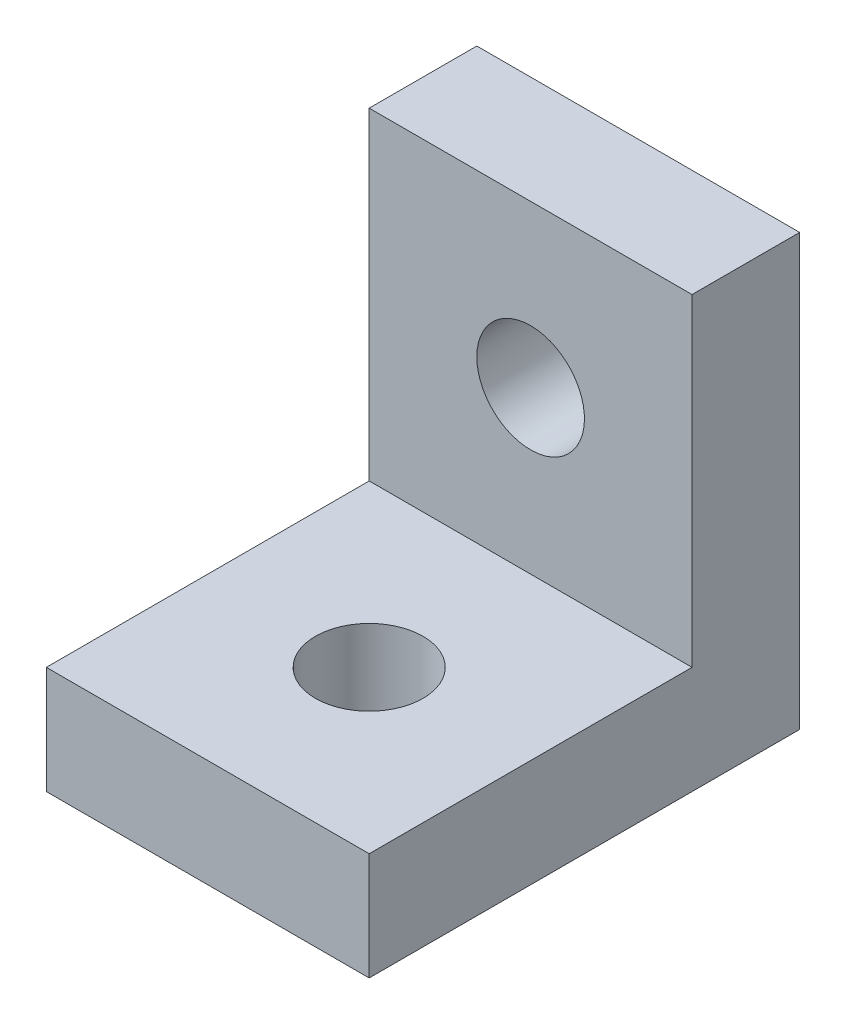
ISO-10303-21;
HEADER;
FILE_DESCRIPTION(('STEP AP214'),'2;1');
FILE_NAME('part.step','',(''),(''),'','','');
FILE_SCHEMA(('AUTOMOTIVE_DESIGN { 1 0 10303 214 1 1 1 1 }'));
ENDSEC;
DATA;
#1=APPLICATION_CONTEXT('core data for automotive mechanical design processes');
#2=APPLICATION_PROTOCOL_DEFINITION('international standard','automotive_design',2000,#1);
#3=PRODUCT_CONTEXT('',#1,'mechanical');
#4=PRODUCT('Part','Part','',(#3));
#5=PRODUCT_RELATED_PRODUCT_CATEGORY('part','',(#4));
#6=PRODUCT_DEFINITION_FORMATION('','',#4);
#7=PRODUCT_DEFINITION_CONTEXT('part definition',#1,'design');
#8=PRODUCT_DEFINITION('design','',#6,#7);
#9=PRODUCT_DEFINITION_SHAPE('','',#8);
#10=(LENGTH_UNIT() NAMED_UNIT(*) SI_UNIT(.MILLI.,.METRE.));
#11=(NAMED_UNIT(*) PLANE_ANGLE_UNIT() SI_UNIT($,.RADIAN.));
#12=(NAMED_UNIT(*) SI_UNIT($,.STERADIAN.) SOLID_ANGLE_UNIT());
#13=UNCERTAINTY_MEASURE_WITH_UNIT(LENGTH_MEASURE(1.E-05),#10,'distance_accuracy_value','');
#14=(GEOMETRIC_REPRESENTATION_CONTEXT(3) GLOBAL_UNCERTAINTY_ASSIGNED_CONTEXT((#13)) GLOBAL_UNIT_ASSIGNED_CONTEXT((#10,
#11,#12)) REPRESENTATION_CONTEXT('',''));
#15=CARTESIAN_POINT('',(0.,0.,0.));
#16=DIRECTION('',(0.,0.,1.));
#17=DIRECTION('',(1.,0.,0.));
#18=AXIS2_PLACEMENT_3D('',#15,#16,#17);
#19=CARTESIAN_POINT('',(15.,40.,0.));
#20=DIRECTION('',(0.,-1.,0.));
#21=DIRECTION('',(0.,0.,-1.));
#22=AXIS2_PLACEMENT_3D('',#19,#20,#21);
#23=PLANE('',#22);
#24=DIRECTION('',(0.,0.,1.));
#25=VECTOR('',#24,1.);
#26=CARTESIAN_POINT('',(-15.,40.,0.));
#27=LINE('',#26,#25);
#28=CARTESIAN_POINT('',(-15.,40.,0.));
#29=VERTEX_POINT('',#28);
#30=CARTESIAN_POINT('',(-15.,40.,10.));
#31=VERTEX_POINT('',#30);
#32=EDGE_CURVE('E123',#29,#31,#27,.T.);
#33=ORIENTED_EDGE('',*,*,#32,.T.);
#34=DIRECTION('',(-1.,0.,0.));
#35=VECTOR('',#34,1.);
#36=CARTESIAN_POINT('',(15.,40.,10.));
#37=LINE('',#36,#35);
#38=CARTESIAN_POINT('',(15.,40.,10.));
#39=VERTEX_POINT('',#38);
#40=EDGE_CURVE('E11',#39,#31,#37,.T.);
#41=ORIENTED_EDGE('',*,*,#40,.F.);
#42=DIRECTION('',(0.,0.,1.));
#43=VECTOR('',#42,1.);
#44=CARTESIAN_POINT('',(15.,40.,0.));
#45=LINE('',#44,#43);
#46=CARTESIAN_POINT('',(15.,40.,0.));
#47=VERTEX_POINT('',#46);
#48=EDGE_CURVE('E134',#47,#39,#45,.T.);
#49=ORIENTED_EDGE('',*,*,#48,.F.);
#50=DIRECTION('',(-1.,0.,0.));
#51=VECTOR('',#50,1.);
#52=CARTESIAN_POINT('',(15.,40.,0.));
#53=LINE('',#52,#51);
#54=EDGE_CURVE('E119',#47,#29,#53,.T.);
#55=ORIENTED_EDGE('',*,*,#54,.T.);
#56=EDGE_LOOP('',(#33,#41,#49,#55));
#57=FACE_BOUND('',#56,.T.);
#58=ADVANCED_FACE('F39',(#57),#23,.F.);
#59=CARTESIAN_POINT('',(15.,40.,10.));
#60=DIRECTION('',(0.,0.,-1.));
#61=DIRECTION('',(-1.,0.,0.));
#62=AXIS2_PLACEMENT_3D('',#59,#60,#61);
#63=PLANE('',#62);
#64=CARTESIAN_POINT('',(0.,25.,10.));
#65=DIRECTION('',(0.,0.,-1.));
#66=DIRECTION('',(-1.,0.,0.));
#67=AXIS2_PLACEMENT_3D('',#64,#65,#66);
#68=CIRCLE('',#67,5.);
#69=CARTESIAN_POINT('',(-5.,25.,10.));
#70=VERTEX_POINT('',#69);
#71=EDGE_CURVE('E127',#70,#70,#68,.F.);
#72=ORIENTED_EDGE('',*,*,#71,.F.);
#73=EDGE_LOOP('',(#72));
#74=FACE_BOUND('',#73,.T.);
#75=DIRECTION('',(0.,-1.,0.));
#76=VECTOR('',#75,1.);
#77=CARTESIAN_POINT('',(-15.,40.,10.));
#78=LINE('',#77,#76);
#79=CARTESIAN_POINT('',(-15.,10.,10.));
#80=VERTEX_POINT('',#79);
#81=EDGE_CURVE('E126',#31,#80,#78,.T.);
#82=ORIENTED_EDGE('',*,*,#81,.T.);
#83=DIRECTION('',(-1.,0.,0.));
#84=VECTOR('',#83,1.);
#85=CARTESIAN_POINT('',(15.,10.,10.));
#86=LINE('',#85,#84);
#87=CARTESIAN_POINT('',(15.,10.,10.));
#88=VERTEX_POINT('',#87);
#89=EDGE_CURVE('E47',#88,#80,#86,.T.);
#90=ORIENTED_EDGE('',*,*,#89,.F.);
#91=DIRECTION('',(0.,-1.,0.));
#92=VECTOR('',#91,1.);
#93=CARTESIAN_POINT('',(15.,40.,10.));
#94=LINE('',#93,#92);
#95=EDGE_CURVE('E92',#39,#88,#94,.T.);
#96=ORIENTED_EDGE('',*,*,#95,.F.);
#97=ORIENTED_EDGE('',*,*,#40,.T.);
#98=EDGE_LOOP('',(#82,#90,#96,#97));
#99=FACE_BOUND('',#98,.T.);
#100=ADVANCED_FACE('F161',(#74,#99),#63,.F.);
#101=CARTESIAN_POINT('',(15.,10.,10.));
#102=DIRECTION('',(0.,-1.,0.));
#103=DIRECTION('',(0.,0.,-1.));
#104=AXIS2_PLACEMENT_3D('',#101,#102,#103);
#105=PLANE('',#104);
#106=CARTESIAN_POINT('',(0.,10.,25.));
#107=DIRECTION('',(0.,1.,0.));
#108=DIRECTION('',(0.,0.,1.));
#109=AXIS2_PLACEMENT_3D('',#106,#107,#108);
#110=CIRCLE('',#109,5.);
#111=CARTESIAN_POINT('',(0.,10.,30.));
#112=VERTEX_POINT('',#111);
#113=EDGE_CURVE('E249',#112,#112,#110,.T.);
#114=ORIENTED_EDGE('',*,*,#113,.F.);
#115=EDGE_LOOP('',(#114));
#116=FACE_BOUND('',#115,.T.);
#117=DIRECTION('',(0.,0.,1.));
#118=VECTOR('',#117,1.);
#119=CARTESIAN_POINT('',(-15.,10.,10.));
#120=LINE('',#119,#118);
#121=CARTESIAN_POINT('',(-15.,10.,40.));
#122=VERTEX_POINT('',#121);
#123=EDGE_CURVE('E129',#80,#122,#120,.T.);
#124=ORIENTED_EDGE('',*,*,#123,.T.);
#125=DIRECTION('',(-1.,0.,0.));
#126=VECTOR('',#125,1.);
#127=CARTESIAN_POINT('',(15.,10.,40.));
#128=LINE('',#127,#126);
#129=CARTESIAN_POINT('',(15.,10.,40.));
#130=VERTEX_POINT('',#129);
#131=EDGE_CURVE('E114',#130,#122,#128,.T.);
#132=ORIENTED_EDGE('',*,*,#131,.F.);
#133=DIRECTION('',(0.,0.,1.));
#134=VECTOR('',#133,1.);
#135=CARTESIAN_POINT('',(15.,10.,10.));
#136=LINE('',#135,#134);
#137=EDGE_CURVE('E105',#88,#130,#136,.T.);
#138=ORIENTED_EDGE('',*,*,#137,.F.);
#139=ORIENTED_EDGE('',*,*,#89,.T.);
#140=EDGE_LOOP('',(#124,#132,#138,#139));
#141=FACE_BOUND('',#140,.T.);
#142=ADVANCED_FACE('F140',(#116,#141),#105,.F.);
#143=CARTESIAN_POINT('',(15.,0.,40.));
#144=DIRECTION('',(0.,0.,-1.));
#145=DIRECTION('',(-1.,0.,0.));
#146=AXIS2_PLACEMENT_3D('',#143,#144,#145);
#147=PLANE('',#146);
#148=DIRECTION('',(0.,-1.,0.));
#149=VECTOR('',#148,1.);
#150=CARTESIAN_POINT('',(-15.,0.,40.));
#151=LINE('',#150,#149);
#152=CARTESIAN_POINT('',(-15.,0.,40.));
#153=VERTEX_POINT('',#152);
#154=EDGE_CURVE('E113',#122,#153,#151,.T.);
#155=ORIENTED_EDGE('',*,*,#154,.T.);
#156=DIRECTION('',(-1.,0.,0.));
#157=VECTOR('',#156,1.);
#158=CARTESIAN_POINT('',(15.,0.,40.));
#159=LINE('',#158,#157);
#160=CARTESIAN_POINT('',(15.,0.,40.));
#161=VERTEX_POINT('',#160);
#162=EDGE_CURVE('E110',#161,#153,#159,.T.);
#163=ORIENTED_EDGE('',*,*,#162,.F.);
#164=DIRECTION('',(0.,-1.,0.));
#165=VECTOR('',#164,1.);
#166=CARTESIAN_POINT('',(15.,0.,40.));
#167=LINE('',#166,#165);
#168=EDGE_CURVE('E99',#130,#161,#167,.T.);
#169=ORIENTED_EDGE('',*,*,#168,.F.);
#170=ORIENTED_EDGE('',*,*,#131,.T.);
#171=EDGE_LOOP('',(#155,#163,#169,#170));
#172=FACE_BOUND('',#171,.T.);
#173=ADVANCED_FACE('F111',(#172),#147,.F.);
#174=CARTESIAN_POINT('',(15.,0.,0.));
#175=DIRECTION('',(0.,1.,0.));
#176=DIRECTION('',(0.,0.,1.));
#177=AXIS2_PLACEMENT_3D('',#174,#175,#176);
#178=PLANE('',#177);
#179=CARTESIAN_POINT('',(0.,0.,25.));
#180=DIRECTION('',(0.,1.,0.));
#181=DIRECTION('',(0.,0.,1.));
#182=AXIS2_PLACEMENT_3D('',#179,#180,#181);
#183=CIRCLE('',#182,5.);
#184=CARTESIAN_POINT('',(0.,0.,30.));
#185=VERTEX_POINT('',#184);
#186=EDGE_CURVE('E242',#185,#185,#183,.F.);
#187=ORIENTED_EDGE('',*,*,#186,.F.);
#188=EDGE_LOOP('',(#187));
#189=FACE_BOUND('',#188,.T.);
#190=DIRECTION('',(0.,0.,-1.));
#191=VECTOR('',#190,1.);
#192=CARTESIAN_POINT('',(-15.,0.,0.));
#193=LINE('',#192,#191);
#194=CARTESIAN_POINT('',(-15.,0.,0.));
#195=VERTEX_POINT('',#194);
#196=EDGE_CURVE('E78',#153,#195,#193,.T.);
#197=ORIENTED_EDGE('',*,*,#196,.T.);
#198=DIRECTION('',(-1.,0.,0.));
#199=VECTOR('',#198,1.);
#200=CARTESIAN_POINT('',(15.,0.,0.));
#201=LINE('',#200,#199);
#202=CARTESIAN_POINT('',(15.,0.,0.));
#203=VERTEX_POINT('',#202);
#204=EDGE_CURVE('E115',#203,#195,#201,.T.);
#205=ORIENTED_EDGE('',*,*,#204,.F.);
#206=DIRECTION('',(0.,0.,-1.));
#207=VECTOR('',#206,1.);
#208=CARTESIAN_POINT('',(15.,0.,0.));
#209=LINE('',#208,#207);
#210=EDGE_CURVE('E103',#161,#203,#209,.T.);
#211=ORIENTED_EDGE('',*,*,#210,.F.);
#212=ORIENTED_EDGE('',*,*,#162,.T.);
#213=EDGE_LOOP('',(#197,#205,#211,#212));
#214=FACE_BOUND('',#213,.T.);
#215=ADVANCED_FACE('F117',(#189,#214),#178,.F.);
#216=CARTESIAN_POINT('',(15.,40.,0.));
#217=DIRECTION('',(0.,0.,1.));
#218=DIRECTION('',(0.,-1.,0.));
#219=AXIS2_PLACEMENT_3D('',#216,#217,#218);
#220=PLANE('',#219);
#221=CARTESIAN_POINT('',(0.,25.,0.));
#222=DIRECTION('',(0.,0.,-1.));
#223=DIRECTION('',(0.,1.,0.));
#224=AXIS2_PLACEMENT_3D('',#221,#222,#223);
#225=CIRCLE('',#224,5.);
#226=CARTESIAN_POINT('',(0.,30.,0.));
#227=VERTEX_POINT('',#226);
#228=EDGE_CURVE('E239',#227,#227,#225,.T.);
#229=ORIENTED_EDGE('',*,*,#228,.F.);
#230=EDGE_LOOP('',(#229));
#231=FACE_BOUND('',#230,.T.);
#232=DIRECTION('',(0.,1.,0.));
#233=VECTOR('',#232,1.);
#234=CARTESIAN_POINT('',(-15.,40.,0.));
#235=LINE('',#234,#233);
#236=EDGE_CURVE('E84',#195,#29,#235,.T.);
#237=ORIENTED_EDGE('',*,*,#236,.T.);
#238=ORIENTED_EDGE('',*,*,#54,.F.);
#239=DIRECTION('',(0.,1.,0.));
#240=VECTOR('',#239,1.);
#241=CARTESIAN_POINT('',(15.,40.,0.));
#242=LINE('',#241,#240);
#243=EDGE_CURVE('E55',#203,#47,#242,.T.);
#244=ORIENTED_EDGE('',*,*,#243,.F.);
#245=ORIENTED_EDGE('',*,*,#204,.T.);
#246=EDGE_LOOP('',(#237,#238,#244,#245));
#247=FACE_BOUND('',#246,.T.);
#248=ADVANCED_FACE('F147',(#231,#247),#220,.F.);
#249=CARTESIAN_POINT('',(15.,0.,0.));
#250=DIRECTION('',(1.,0.,0.));
#251=DIRECTION('',(0.,0.,-1.));
#252=AXIS2_PLACEMENT_3D('',#249,#250,#251);
#253=PLANE('',#252);
#254=ORIENTED_EDGE('',*,*,#48,.T.);
#255=ORIENTED_EDGE('',*,*,#95,.T.);
#256=ORIENTED_EDGE('',*,*,#137,.T.);
#257=ORIENTED_EDGE('',*,*,#168,.T.);
#258=ORIENTED_EDGE('',*,*,#210,.T.);
#259=ORIENTED_EDGE('',*,*,#243,.T.);
#260=EDGE_LOOP('',(#254,#255,#256,#257,#258,#259));
#261=FACE_BOUND('',#260,.T.);
#262=ADVANCED_FACE('F101',(#261),#253,.T.);
#263=CARTESIAN_POINT('',(-15.,0.,0.));
#264=DIRECTION('',(1.,0.,0.));
#265=DIRECTION('',(0.,0.,-1.));
#266=AXIS2_PLACEMENT_3D('',#263,#264,#265);
#267=PLANE('',#266);
#268=ORIENTED_EDGE('',*,*,#32,.F.);
#269=ORIENTED_EDGE('',*,*,#236,.F.);
#270=ORIENTED_EDGE('',*,*,#196,.F.);
#271=ORIENTED_EDGE('',*,*,#154,.F.);
#272=ORIENTED_EDGE('',*,*,#123,.F.);
#273=ORIENTED_EDGE('',*,*,#81,.F.);
#274=EDGE_LOOP('',(#268,#269,#270,#271,#272,#273));
#275=FACE_BOUND('',#274,.T.);
#276=ADVANCED_FACE('F143',(#275),#267,.F.);
#277=CARTESIAN_POINT('',(0.,25.,40.001));
#278=DIRECTION('',(0.,0.,-1.));
#279=DIRECTION('',(0.,1.,0.));
#280=AXIS2_PLACEMENT_3D('',#277,#278,#279);
#281=CYLINDRICAL_SURFACE('',#280,5.);
#282=ORIENTED_EDGE('',*,*,#228,.T.);
#283=EDGE_LOOP('',(#282));
#284=FACE_BOUND('',#283,.T.);
#285=ORIENTED_EDGE('',*,*,#71,.T.);
#286=EDGE_LOOP('',(#285));
#287=FACE_BOUND('',#286,.T.);
#288=ADVANCED_FACE('F196',(#284,#287),#281,.F.);
#289=CARTESIAN_POINT('',(0.,-0.000999999999999265,25.));
#290=DIRECTION('',(0.,1.,0.));
#291=DIRECTION('',(0.,0.,1.));
#292=AXIS2_PLACEMENT_3D('',#289,#290,#291);
#293=CYLINDRICAL_SURFACE('',#292,5.);
#294=ORIENTED_EDGE('',*,*,#113,.T.);
#295=EDGE_LOOP('',(#294));
#296=FACE_BOUND('',#295,.T.);
#297=ORIENTED_EDGE('',*,*,#186,.T.);
#298=EDGE_LOOP('',(#297));
#299=FACE_BOUND('',#298,.T.);
#300=ADVANCED_FACE('F192',(#296,#299),#293,.F.);
#301=CLOSED_SHELL('',(#58,#100,#142,#173,#215,#248,#262,#276,#288,#300));
#302=MANIFOLD_SOLID_BREP('B2',#301);
#303=ADVANCED_BREP_SHAPE_REPRESENTATION('',(#18,#302),#14);
#304=SHAPE_DEFINITION_REPRESENTATION(#9,#303);
ENDSEC;
END-ISO-10303-21;
